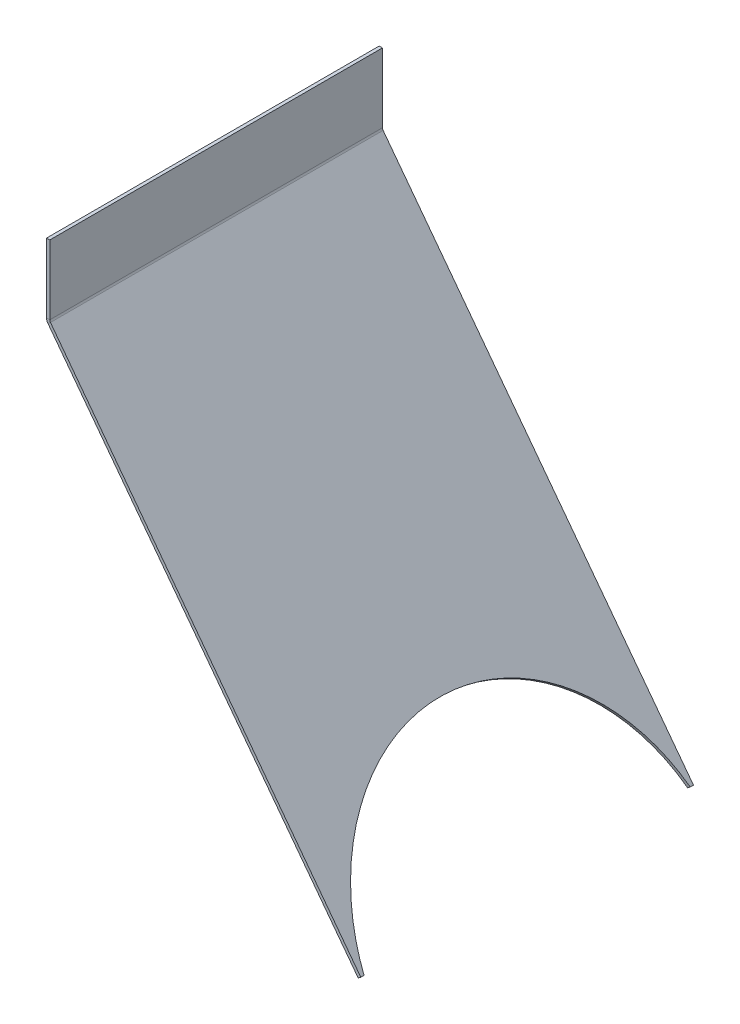
ISO-10303-21;
HEADER;
FILE_DESCRIPTION(('STEP AP214'),'2;1');
FILE_NAME('part.step','',(''),(''),'','','');
FILE_SCHEMA(('AUTOMOTIVE_DESIGN { 1 0 10303 214 1 1 1 1 }'));
ENDSEC;
DATA;
#1=APPLICATION_CONTEXT('core data for automotive mechanical design processes');
#2=APPLICATION_PROTOCOL_DEFINITION('international standard','automotive_design',2000,#1);
#3=PRODUCT_CONTEXT('',#1,'mechanical');
#4=PRODUCT('Part','Part','',(#3));
#5=PRODUCT_RELATED_PRODUCT_CATEGORY('part','',(#4));
#6=PRODUCT_DEFINITION_FORMATION('','',#4);
#7=PRODUCT_DEFINITION_CONTEXT('part definition',#1,'design');
#8=PRODUCT_DEFINITION('design','',#6,#7);
#9=PRODUCT_DEFINITION_SHAPE('','',#8);
#10=(LENGTH_UNIT() NAMED_UNIT(*) SI_UNIT(.MILLI.,.METRE.));
#11=(NAMED_UNIT(*) PLANE_ANGLE_UNIT() SI_UNIT($,.RADIAN.));
#12=(NAMED_UNIT(*) SI_UNIT($,.STERADIAN.) SOLID_ANGLE_UNIT());
#13=UNCERTAINTY_MEASURE_WITH_UNIT(LENGTH_MEASURE(1.E-05),#10,'distance_accuracy_value','');
#14=(GEOMETRIC_REPRESENTATION_CONTEXT(3) GLOBAL_UNCERTAINTY_ASSIGNED_CONTEXT((#13)) GLOBAL_UNIT_ASSIGNED_CONTEXT((#10,
#11,#12)) REPRESENTATION_CONTEXT('',''));
#15=CARTESIAN_POINT('',(0.,0.,0.));
#16=DIRECTION('',(0.,0.,1.));
#17=DIRECTION('',(1.,0.,0.));
#18=AXIS2_PLACEMENT_3D('',#15,#16,#17);
#19=CARTESIAN_POINT('',(-191.151037261948,344.875447906096,101.99999999542));
#20=DIRECTION('',(0.,-1.,0.));
#21=DIRECTION('',(0.,0.,-1.));
#22=AXIS2_PLACEMENT_3D('',#19,#20,#21);
#23=PLANE('',#22);
#24=DIRECTION('',(1.,0.,0.));
#25=VECTOR('',#24,1.);
#26=CARTESIAN_POINT('',(-191.151037261948,344.875447906096,-102.00000000458));
#27=LINE('',#26,#25);
#28=CARTESIAN_POINT('',(-193.151037261948,344.875447906096,-102.00000000458));
#29=VERTEX_POINT('',#28);
#30=CARTESIAN_POINT('',(-191.151037261948,344.875447906096,-102.00000000458));
#31=VERTEX_POINT('',#30);
#32=EDGE_CURVE('E11',#29,#31,#27,.T.);
#33=ORIENTED_EDGE('',*,*,#32,.F.);
#34=DIRECTION('',(0.,0.,1.));
#35=VECTOR('',#34,1.);
#36=CARTESIAN_POINT('',(-193.151037261948,344.875447906096,101.99999999542));
#37=LINE('',#36,#35);
#38=CARTESIAN_POINT('',(-193.151037261948,344.875447906096,101.99999999542));
#39=VERTEX_POINT('',#38);
#40=EDGE_CURVE('E96',#39,#29,#37,.F.);
#41=ORIENTED_EDGE('',*,*,#40,.F.);
#42=DIRECTION('',(1.,0.,0.));
#43=VECTOR('',#42,1.);
#44=CARTESIAN_POINT('',(-191.151037261948,344.875447906096,101.99999999542));
#45=LINE('',#44,#43);
#46=CARTESIAN_POINT('',(-191.151037261948,344.875447906096,101.99999999542));
#47=VERTEX_POINT('',#46);
#48=EDGE_CURVE('E51',#39,#47,#45,.T.);
#49=ORIENTED_EDGE('',*,*,#48,.T.);
#50=DIRECTION('',(0.,0.,-1.));
#51=VECTOR('',#50,1.);
#52=CARTESIAN_POINT('',(-191.151037261948,344.875447906096,101.99999999542));
#53=LINE('',#52,#51);
#54=EDGE_CURVE('E98',#47,#31,#53,.T.);
#55=ORIENTED_EDGE('',*,*,#54,.T.);
#56=EDGE_LOOP('',(#33,#41,#49,#55));
#57=FACE_BOUND('',#56,.T.);
#58=ADVANCED_FACE('F41',(#57),#23,.F.);
#59=CARTESIAN_POINT('',(-191.151037261948,344.875447906096,101.99999999542));
#60=DIRECTION('',(0.,0.,1.));
#61=DIRECTION('',(0.,-1.,0.));
#62=AXIS2_PLACEMENT_3D('',#59,#60,#61);
#63=PLANE('',#62);
#64=ORIENTED_EDGE('',*,*,#48,.F.);
#65=DIRECTION('',(0.,1.,0.));
#66=VECTOR('',#65,1.);
#67=CARTESIAN_POINT('',(-193.151037261948,344.875447906096,101.99999999542));
#68=LINE('',#67,#66);
#69=CARTESIAN_POINT('',(-193.151037261948,302.462633045061,101.99999999542));
#70=VERTEX_POINT('',#69);
#71=EDGE_CURVE('E111',#39,#70,#68,.F.);
#72=ORIENTED_EDGE('',*,*,#71,.T.);
#73=DIRECTION('',(1.,0.,0.));
#74=VECTOR('',#73,1.);
#75=CARTESIAN_POINT('',(-191.151037261948,302.462633045061,101.99999999542));
#76=LINE('',#75,#74);
#77=CARTESIAN_POINT('',(-191.151037261948,302.462633045061,101.99999999542));
#78=VERTEX_POINT('',#77);
#79=EDGE_CURVE('E138',#70,#78,#76,.T.);
#80=ORIENTED_EDGE('',*,*,#79,.T.);
#81=DIRECTION('',(0.,-1.,0.));
#82=VECTOR('',#81,1.);
#83=CARTESIAN_POINT('',(-191.151037261948,344.875447906096,101.99999999542));
#84=LINE('',#83,#82);
#85=EDGE_CURVE('E150',#47,#78,#84,.T.);
#86=ORIENTED_EDGE('',*,*,#85,.F.);
#87=EDGE_LOOP('',(#64,#72,#80,#86));
#88=FACE_BOUND('',#87,.T.);
#89=ADVANCED_FACE('F154',(#88),#63,.T.);
#90=CARTESIAN_POINT('',(-189.151037261948,302.462633045061,101.99999999542));
#91=DIRECTION('',(0.,0.,-1.));
#92=DIRECTION('',(-1.,0.,0.));
#93=AXIS2_PLACEMENT_3D('',#90,#91,#92);
#94=PLANE('',#93);
#95=ORIENTED_EDGE('',*,*,#79,.F.);
#96=CARTESIAN_POINT('',(-189.151037261948,302.462633045061,101.99999999542));
#97=DIRECTION('',(0.,0.,-1.));
#98=DIRECTION('',(-1.,0.,0.));
#99=AXIS2_PLACEMENT_3D('',#96,#97,#98);
#100=CIRCLE('',#99,4.);
#101=CARTESIAN_POINT('',(-192.345579302138,300.055372952452,101.99999999542));
#102=VERTEX_POINT('',#101);
#103=EDGE_CURVE('E405',#70,#102,#100,.F.);
#104=ORIENTED_EDGE('',*,*,#103,.T.);
#105=DIRECTION('',(0.798635510047292,0.60181502315205,0.));
#106=VECTOR('',#105,1.);
#107=CARTESIAN_POINT('',(-190.748308282043,301.259002998756,101.99999999542));
#108=LINE('',#107,#106);
#109=CARTESIAN_POINT('',(-190.748308282043,301.259002998756,101.99999999542));
#110=VERTEX_POINT('',#109);
#111=EDGE_CURVE('E135',#102,#110,#108,.T.);
#112=ORIENTED_EDGE('',*,*,#111,.T.);
#113=CARTESIAN_POINT('',(-189.151037261948,302.462633045061,101.99999999542));
#114=DIRECTION('',(0.,0.,1.));
#115=DIRECTION('',(1.,0.,0.));
#116=AXIS2_PLACEMENT_3D('',#113,#114,#115);
#117=CIRCLE('',#116,2.);
#118=EDGE_CURVE('E418',#78,#110,#117,.T.);
#119=ORIENTED_EDGE('',*,*,#118,.F.);
#120=EDGE_LOOP('',(#95,#104,#112,#119));
#121=FACE_BOUND('',#120,.T.);
#122=ADVANCED_FACE('F200',(#121),#94,.F.);
#123=CARTESIAN_POINT('',(-191.553766241854,302.327881813356,101.99999999542));
#124=DIRECTION('',(0.,0.,1.));
#125=DIRECTION('',(0.60181502315205,-0.798635510047292,0.));
#126=AXIS2_PLACEMENT_3D('',#123,#124,#125);
#127=PLANE('',#126);
#128=ORIENTED_EDGE('',*,*,#111,.F.);
#129=DIRECTION('',(-0.60181502315205,0.798635510047292,0.));
#130=VECTOR('',#129,1.);
#131=CARTESIAN_POINT('',(-193.151037261948,301.124251767052,101.99999999542));
#132=LINE('',#131,#130);
#133=CARTESIAN_POINT('',(-2.03289725008193,47.5019137465814,101.99999999542));
#134=VERTEX_POINT('',#133);
#135=EDGE_CURVE('E400',#102,#134,#132,.F.);
#136=ORIENTED_EDGE('',*,*,#135,.T.);
#137=DIRECTION('',(0.798635510047292,0.60181502315205,0.));
#138=VECTOR('',#137,1.);
#139=CARTESIAN_POINT('',(-0.435626229987367,48.7055437928855,101.99999999542));
#140=LINE('',#139,#138);
#141=CARTESIAN_POINT('',(-0.435626229987367,48.7055437928855,101.99999999542));
#142=VERTEX_POINT('',#141);
#143=EDGE_CURVE('E130',#134,#142,#140,.T.);
#144=ORIENTED_EDGE('',*,*,#143,.T.);
#145=DIRECTION('',(0.60181502315205,-0.798635510047292,0.));
#146=VECTOR('',#145,1.);
#147=CARTESIAN_POINT('',(-191.553766241854,302.327881813356,101.99999999542));
#148=LINE('',#147,#146);
#149=EDGE_CURVE('E171',#110,#142,#148,.T.);
#150=ORIENTED_EDGE('',*,*,#149,.F.);
#151=EDGE_LOOP('',(#128,#136,#144,#150));
#152=FACE_BOUND('',#151,.T.);
#153=ADVANCED_FACE('F196',(#152),#127,.T.);
#154=CARTESIAN_POINT('',(-0.435626229987392,48.7055437928855,100.00000000458));
#155=DIRECTION('',(-0.60181502315205,0.798635510047292,0.));
#156=DIRECTION('',(0.,0.,1.));
#157=AXIS2_PLACEMENT_3D('',#154,#155,#156);
#158=PLANE('',#157);
#159=ORIENTED_EDGE('',*,*,#143,.F.);
#160=DIRECTION('',(0.,0.,1.));
#161=VECTOR('',#160,1.);
#162=CARTESIAN_POINT('',(-2.03289725008199,47.5019137465815,101.99999999542));
#163=LINE('',#162,#161);
#164=CARTESIAN_POINT('',(-2.03289725008227,47.5019137465812,100.00000000458));
#165=VERTEX_POINT('',#164);
#166=EDGE_CURVE('E410',#165,#134,#163,.T.);
#167=ORIENTED_EDGE('',*,*,#166,.F.);
#168=DIRECTION('',(0.798635510047292,0.60181502315205,0.));
#169=VECTOR('',#168,1.);
#170=CARTESIAN_POINT('',(-0.435626229987392,48.7055437928855,100.00000000458));
#171=LINE('',#170,#169);
#172=CARTESIAN_POINT('',(-0.435626229987392,48.7055437928855,100.00000000458));
#173=VERTEX_POINT('',#172);
#174=EDGE_CURVE('E126',#165,#173,#171,.T.);
#175=ORIENTED_EDGE('',*,*,#174,.T.);
#176=DIRECTION('',(0.,0.,1.));
#177=VECTOR('',#176,1.);
#178=CARTESIAN_POINT('',(-0.435626229987392,48.7055437928855,100.00000000458));
#179=LINE('',#178,#177);
#180=EDGE_CURVE('E174',#173,#142,#179,.T.);
#181=ORIENTED_EDGE('',*,*,#180,.T.);
#182=EDGE_LOOP('',(#159,#167,#175,#181));
#183=FACE_BOUND('',#182,.T.);
#184=ADVANCED_FACE('F192',(#183),#158,.F.);
#185=CARTESIAN_POINT('',(14.62993641412,28.7128669012238,0.));
#186=DIRECTION('',(0.798635510047292,0.60181502315205,0.));
#187=DIRECTION('',(0.60181502315205,-0.798635510047292,0.));
#188=AXIS2_PLACEMENT_3D('',#185,#186,#187);
#189=ELLIPSE('',#188,114.041698898707,102.5);
#190=DIRECTION('',(0.798635510047292,0.60181502315205,0.));
#191=VECTOR('',#190,1.);
#192=SURFACE_OF_LINEAR_EXTRUSION('',#189,#191);
#193=ORIENTED_EDGE('',*,*,#174,.F.);
#194=CARTESIAN_POINT('',(13.0326653940255,27.5092368549197,0.));
#195=DIRECTION('',(0.798635510047292,0.60181502315205,0.));
#196=DIRECTION('',(0.60181502315205,-0.798635510047292,0.));
#197=AXIS2_PLACEMENT_3D('',#194,#195,#196);
#198=ELLIPSE('',#197,114.041698898707,102.5);
#199=CARTESIAN_POINT('',(-2.03289725008227,47.5019137465812,-100.00000000458));
#200=VERTEX_POINT('',#199);
#201=EDGE_CURVE('E406',#200,#165,#198,.T.);
#202=ORIENTED_EDGE('',*,*,#201,.F.);
#203=DIRECTION('',(0.798635510047292,0.60181502315205,0.));
#204=VECTOR('',#203,1.);
#205=CARTESIAN_POINT('',(-0.435626229987975,48.7055437928851,-100.00000000458));
#206=LINE('',#205,#204);
#207=CARTESIAN_POINT('',(-0.435626229987975,48.7055437928851,-100.00000000458));
#208=VERTEX_POINT('',#207);
#209=EDGE_CURVE('E59',#200,#208,#206,.T.);
#210=ORIENTED_EDGE('',*,*,#209,.T.);
#211=EDGE_CURVE('E177',#208,#173,#189,.T.);
#212=ORIENTED_EDGE('',*,*,#211,.T.);
#213=EDGE_LOOP('',(#193,#202,#210,#212));
#214=FACE_BOUND('',#213,.T.);
#215=ADVANCED_FACE('F187',(#214),#192,.F.);
#216=CARTESIAN_POINT('',(-0.435626229987385,48.7055437928855,-102.00000000458));
#217=DIRECTION('',(-0.60181502315205,0.798635510047292,0.));
#218=DIRECTION('',(0.,0.,1.));
#219=AXIS2_PLACEMENT_3D('',#216,#217,#218);
#220=PLANE('',#219);
#221=ORIENTED_EDGE('',*,*,#209,.F.);
#222=DIRECTION('',(0.,0.,1.));
#223=VECTOR('',#222,1.);
#224=CARTESIAN_POINT('',(-2.03289725008199,47.5019137465815,101.99999999542));
#225=LINE('',#224,#223);
#226=CARTESIAN_POINT('',(-2.03289725008199,47.5019137465815,-102.00000000458));
#227=VERTEX_POINT('',#226);
#228=EDGE_CURVE('E415',#227,#200,#225,.T.);
#229=ORIENTED_EDGE('',*,*,#228,.F.);
#230=DIRECTION('',(0.798635510047292,0.60181502315205,0.));
#231=VECTOR('',#230,1.);
#232=CARTESIAN_POINT('',(-0.435626229987385,48.7055437928855,-102.00000000458));
#233=LINE('',#232,#231);
#234=CARTESIAN_POINT('',(-0.435626229987385,48.7055437928855,-102.00000000458));
#235=VERTEX_POINT('',#234);
#236=EDGE_CURVE('E122',#227,#235,#233,.T.);
#237=ORIENTED_EDGE('',*,*,#236,.T.);
#238=DIRECTION('',(0.,0.,1.));
#239=VECTOR('',#238,1.);
#240=CARTESIAN_POINT('',(-0.435626229987385,48.7055437928855,-102.00000000458));
#241=LINE('',#240,#239);
#242=EDGE_CURVE('E157',#235,#208,#241,.T.);
#243=ORIENTED_EDGE('',*,*,#242,.T.);
#244=EDGE_LOOP('',(#221,#229,#237,#243));
#245=FACE_BOUND('',#244,.T.);
#246=ADVANCED_FACE('F191',(#245),#220,.F.);
#247=CARTESIAN_POINT('',(-191.553766241854,302.327881813356,-102.00000000458));
#248=DIRECTION('',(0.,0.,1.));
#249=DIRECTION('',(0.60181502315205,-0.798635510047292,0.));
#250=AXIS2_PLACEMENT_3D('',#247,#248,#249);
#251=PLANE('',#250);
#252=ORIENTED_EDGE('',*,*,#236,.F.);
#253=DIRECTION('',(-0.60181502315205,0.798635510047292,0.));
#254=VECTOR('',#253,1.);
#255=CARTESIAN_POINT('',(-193.151037261948,301.124251767052,-102.00000000458));
#256=LINE('',#255,#254);
#257=CARTESIAN_POINT('',(-192.345579302138,300.055372952452,-102.00000000458));
#258=VERTEX_POINT('',#257);
#259=EDGE_CURVE('E386',#258,#227,#256,.F.);
#260=ORIENTED_EDGE('',*,*,#259,.F.);
#261=DIRECTION('',(0.798635510047286,0.601815023152057,0.));
#262=VECTOR('',#261,1.);
#263=CARTESIAN_POINT('',(-190.748308282043,301.259002998756,-102.00000000458));
#264=LINE('',#263,#262);
#265=CARTESIAN_POINT('',(-190.748308282043,301.259002998756,-102.00000000458));
#266=VERTEX_POINT('',#265);
#267=EDGE_CURVE('E119',#258,#266,#264,.T.);
#268=ORIENTED_EDGE('',*,*,#267,.T.);
#269=DIRECTION('',(0.60181502315205,-0.798635510047292,0.));
#270=VECTOR('',#269,1.);
#271=CARTESIAN_POINT('',(-191.553766241854,302.327881813356,-102.00000000458));
#272=LINE('',#271,#270);
#273=EDGE_CURVE('E163',#266,#235,#272,.T.);
#274=ORIENTED_EDGE('',*,*,#273,.T.);
#275=EDGE_LOOP('',(#252,#260,#268,#274));
#276=FACE_BOUND('',#275,.T.);
#277=ADVANCED_FACE('F240',(#276),#251,.F.);
#278=CARTESIAN_POINT('',(-189.151037261948,302.462633045061,-102.00000000458));
#279=DIRECTION('',(0.,0.,-1.));
#280=DIRECTION('',(-1.,0.,0.));
#281=AXIS2_PLACEMENT_3D('',#278,#279,#280);
#282=PLANE('',#281);
#283=ORIENTED_EDGE('',*,*,#267,.F.);
#284=CARTESIAN_POINT('',(-189.151037261948,302.462633045061,-102.00000000458));
#285=DIRECTION('',(0.,0.,-1.));
#286=DIRECTION('',(-1.,0.,0.));
#287=AXIS2_PLACEMENT_3D('',#284,#285,#286);
#288=CIRCLE('',#287,4.);
#289=CARTESIAN_POINT('',(-193.151037261948,302.462633045061,-102.00000000458));
#290=VERTEX_POINT('',#289);
#291=EDGE_CURVE('E391',#290,#258,#288,.F.);
#292=ORIENTED_EDGE('',*,*,#291,.F.);
#293=DIRECTION('',(1.,0.,0.));
#294=VECTOR('',#293,1.);
#295=CARTESIAN_POINT('',(-191.151037261948,302.462633045061,-102.00000000458));
#296=LINE('',#295,#294);
#297=CARTESIAN_POINT('',(-191.151037261948,302.462633045061,-102.00000000458));
#298=VERTEX_POINT('',#297);
#299=EDGE_CURVE('E45',#290,#298,#296,.T.);
#300=ORIENTED_EDGE('',*,*,#299,.T.);
#301=CARTESIAN_POINT('',(-189.151037261948,302.462633045061,-102.00000000458));
#302=DIRECTION('',(0.,0.,1.));
#303=DIRECTION('',(1.,0.,0.));
#304=AXIS2_PLACEMENT_3D('',#301,#302,#303);
#305=CIRCLE('',#304,2.);
#306=EDGE_CURVE('E181',#298,#266,#305,.T.);
#307=ORIENTED_EDGE('',*,*,#306,.T.);
#308=EDGE_LOOP('',(#283,#292,#300,#307));
#309=FACE_BOUND('',#308,.T.);
#310=ADVANCED_FACE('F247',(#309),#282,.T.);
#311=CARTESIAN_POINT('',(-191.151037261948,344.875447906096,-102.00000000458));
#312=DIRECTION('',(0.,0.,1.));
#313=DIRECTION('',(0.,-1.,0.));
#314=AXIS2_PLACEMENT_3D('',#311,#312,#313);
#315=PLANE('',#314);
#316=DIRECTION('',(0.,1.,0.));
#317=VECTOR('',#316,1.);
#318=CARTESIAN_POINT('',(-193.151037261948,344.875447906096,-102.00000000458));
#319=LINE('',#318,#317);
#320=EDGE_CURVE('E108',#29,#290,#319,.F.);
#321=ORIENTED_EDGE('',*,*,#320,.F.);
#322=ORIENTED_EDGE('',*,*,#32,.T.);
#323=DIRECTION('',(0.,-1.,0.));
#324=VECTOR('',#323,1.);
#325=CARTESIAN_POINT('',(-191.151037261948,344.875447906096,-102.00000000458));
#326=LINE('',#325,#324);
#327=EDGE_CURVE('E152',#31,#298,#326,.T.);
#328=ORIENTED_EDGE('',*,*,#327,.T.);
#329=ORIENTED_EDGE('',*,*,#299,.F.);
#330=EDGE_LOOP('',(#321,#322,#328,#329));
#331=FACE_BOUND('',#330,.T.);
#332=ADVANCED_FACE('F43',(#331),#315,.F.);
#333=CARTESIAN_POINT('',(-189.151037261948,302.462633045061,101.99999999542));
#334=DIRECTION('',(0.,0.,-1.));
#335=DIRECTION('',(-1.,0.,0.));
#336=AXIS2_PLACEMENT_3D('',#333,#334,#335);
#337=CYLINDRICAL_SURFACE('',#336,2.);
#338=ORIENTED_EDGE('',*,*,#306,.F.);
#339=DIRECTION('',(0.,0.,-1.));
#340=VECTOR('',#339,1.);
#341=CARTESIAN_POINT('',(-191.151037261948,302.462633045061,101.99999999542));
#342=LINE('',#341,#340);
#343=EDGE_CURVE('E155',#78,#298,#342,.T.);
#344=ORIENTED_EDGE('',*,*,#343,.F.);
#345=ORIENTED_EDGE('',*,*,#118,.T.);
#346=DIRECTION('',(0.,0.,-1.));
#347=VECTOR('',#346,1.);
#348=CARTESIAN_POINT('',(-190.748308282043,301.259002998756,101.99999999542));
#349=LINE('',#348,#347);
#350=EDGE_CURVE('E168',#110,#266,#349,.T.);
#351=ORIENTED_EDGE('',*,*,#350,.T.);
#352=EDGE_LOOP('',(#338,#344,#345,#351));
#353=FACE_BOUND('',#352,.T.);
#354=ADVANCED_FACE('F260',(#353),#337,.F.);
#355=CARTESIAN_POINT('',(-191.553766241854,302.327881813356,101.99999999542));
#356=DIRECTION('',(0.798635510047292,0.60181502315205,0.));
#357=DIRECTION('',(-0.60181502315205,0.798635510047292,0.));
#358=AXIS2_PLACEMENT_3D('',#355,#356,#357);
#359=PLANE('',#358);
#360=ORIENTED_EDGE('',*,*,#242,.F.);
#361=ORIENTED_EDGE('',*,*,#273,.F.);
#362=ORIENTED_EDGE('',*,*,#350,.F.);
#363=ORIENTED_EDGE('',*,*,#149,.T.);
#364=ORIENTED_EDGE('',*,*,#180,.F.);
#365=ORIENTED_EDGE('',*,*,#211,.F.);
#366=EDGE_LOOP('',(#360,#361,#362,#363,#364,#365));
#367=FACE_BOUND('',#366,.T.);
#368=ADVANCED_FACE('F345',(#367),#359,.T.);
#369=CARTESIAN_POINT('',(-191.151037261948,344.875447906096,101.99999999542));
#370=DIRECTION('',(1.,0.,0.));
#371=DIRECTION('',(0.,1.,0.));
#372=AXIS2_PLACEMENT_3D('',#369,#370,#371);
#373=PLANE('',#372);
#374=ORIENTED_EDGE('',*,*,#327,.F.);
#375=ORIENTED_EDGE('',*,*,#54,.F.);
#376=ORIENTED_EDGE('',*,*,#85,.T.);
#377=ORIENTED_EDGE('',*,*,#343,.T.);
#378=EDGE_LOOP('',(#374,#375,#376,#377));
#379=FACE_BOUND('',#378,.T.);
#380=ADVANCED_FACE('F148',(#379),#373,.T.);
#381=CARTESIAN_POINT('',(-189.151037261948,302.462633045061,101.99999999542));
#382=DIRECTION('',(0.,0.,-1.));
#383=DIRECTION('',(-1.,0.,0.));
#384=AXIS2_PLACEMENT_3D('',#381,#382,#383);
#385=CYLINDRICAL_SURFACE('',#384,4.);
#386=ORIENTED_EDGE('',*,*,#291,.T.);
#387=DIRECTION('',(0.,0.,-1.));
#388=VECTOR('',#387,1.);
#389=CARTESIAN_POINT('',(-192.345579302138,300.055372952452,101.99999999542));
#390=LINE('',#389,#388);
#391=EDGE_CURVE('E395',#102,#258,#390,.T.);
#392=ORIENTED_EDGE('',*,*,#391,.F.);
#393=ORIENTED_EDGE('',*,*,#103,.F.);
#394=DIRECTION('',(0.,0.,1.));
#395=VECTOR('',#394,1.);
#396=CARTESIAN_POINT('',(-193.151037261948,302.462633045061,101.99999999542));
#397=LINE('',#396,#395);
#398=EDGE_CURVE('E404',#70,#290,#397,.F.);
#399=ORIENTED_EDGE('',*,*,#398,.T.);
#400=EDGE_LOOP('',(#386,#392,#393,#399));
#401=FACE_BOUND('',#400,.T.);
#402=ADVANCED_FACE('F268',(#401),#385,.T.);
#403=CARTESIAN_POINT('',(-193.151037261948,301.124251767052,101.99999999542));
#404=DIRECTION('',(0.798635510047292,0.60181502315205,0.));
#405=DIRECTION('',(-0.60181502315205,0.798635510047292,0.));
#406=AXIS2_PLACEMENT_3D('',#403,#404,#405);
#407=PLANE('',#406);
#408=ORIENTED_EDGE('',*,*,#228,.T.);
#409=ORIENTED_EDGE('',*,*,#201,.T.);
#410=ORIENTED_EDGE('',*,*,#166,.T.);
#411=ORIENTED_EDGE('',*,*,#135,.F.);
#412=ORIENTED_EDGE('',*,*,#391,.T.);
#413=ORIENTED_EDGE('',*,*,#259,.T.);
#414=EDGE_LOOP('',(#408,#409,#410,#411,#412,#413));
#415=FACE_BOUND('',#414,.T.);
#416=ADVANCED_FACE('F272',(#415),#407,.F.);
#417=CARTESIAN_POINT('',(-193.151037261948,344.875447906096,101.99999999542));
#418=DIRECTION('',(1.,0.,0.));
#419=DIRECTION('',(0.,1.,0.));
#420=AXIS2_PLACEMENT_3D('',#417,#418,#419);
#421=PLANE('',#420);
#422=ORIENTED_EDGE('',*,*,#320,.T.);
#423=ORIENTED_EDGE('',*,*,#398,.F.);
#424=ORIENTED_EDGE('',*,*,#71,.F.);
#425=ORIENTED_EDGE('',*,*,#40,.T.);
#426=EDGE_LOOP('',(#422,#423,#424,#425));
#427=FACE_BOUND('',#426,.T.);
#428=ADVANCED_FACE('F106',(#427),#421,.F.);
#429=CLOSED_SHELL('',(#58,#89,#122,#153,#184,#215,#246,#277,#310,#332,#354,#368,#380,#402,#416,#428));
#430=MANIFOLD_SOLID_BREP('B2',#429);
#431=ADVANCED_BREP_SHAPE_REPRESENTATION('',(#18,#430),#14);
#432=SHAPE_DEFINITION_REPRESENTATION(#9,#431);
ENDSEC;
END-ISO-10303-21;
